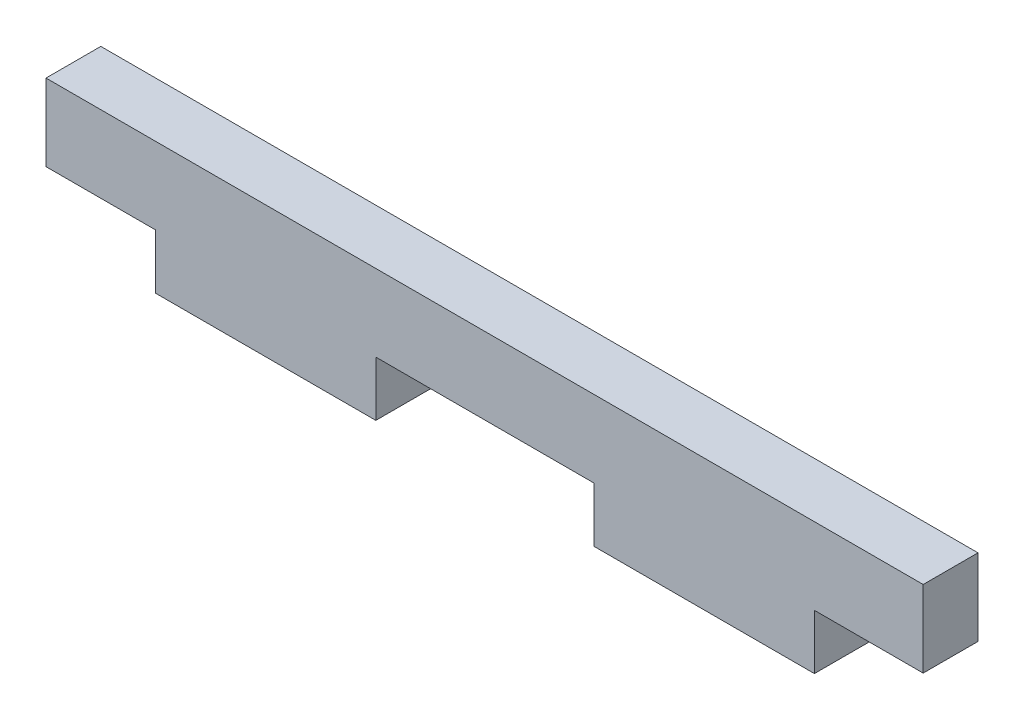
ISO-10303-21;
HEADER;
FILE_DESCRIPTION(('STEP AP214'),'2;1');
FILE_NAME('part.step','',(''),(''),'','','');
FILE_SCHEMA(('AUTOMOTIVE_DESIGN { 1 0 10303 214 1 1 1 1 }'));
ENDSEC;
DATA;
#1=APPLICATION_CONTEXT('core data for automotive mechanical design processes');
#2=APPLICATION_PROTOCOL_DEFINITION('international standard','automotive_design',2000,#1);
#3=PRODUCT_CONTEXT('',#1,'mechanical');
#4=PRODUCT('Part','Part','',(#3));
#5=PRODUCT_RELATED_PRODUCT_CATEGORY('part','',(#4));
#6=PRODUCT_DEFINITION_FORMATION('','',#4);
#7=PRODUCT_DEFINITION_CONTEXT('part definition',#1,'design');
#8=PRODUCT_DEFINITION('design','',#6,#7);
#9=PRODUCT_DEFINITION_SHAPE('','',#8);
#10=(LENGTH_UNIT() NAMED_UNIT(*) SI_UNIT(.MILLI.,.METRE.));
#11=(NAMED_UNIT(*) PLANE_ANGLE_UNIT() SI_UNIT($,.RADIAN.));
#12=(NAMED_UNIT(*) SI_UNIT($,.STERADIAN.) SOLID_ANGLE_UNIT());
#13=UNCERTAINTY_MEASURE_WITH_UNIT(LENGTH_MEASURE(1.E-05),#10,'distance_accuracy_value','');
#14=(GEOMETRIC_REPRESENTATION_CONTEXT(3) GLOBAL_UNCERTAINTY_ASSIGNED_CONTEXT((#13)) GLOBAL_UNIT_ASSIGNED_CONTEXT((#10,
#11,#12)) REPRESENTATION_CONTEXT('',''));
#15=CARTESIAN_POINT('',(0.,0.,0.));
#16=DIRECTION('',(0.,0.,1.));
#17=DIRECTION('',(1.,0.,0.));
#18=AXIS2_PLACEMENT_3D('',#15,#16,#17);
#19=CARTESIAN_POINT('',(19.1008,-2.2225,1.5875));
#20=DIRECTION('',(0.,1.,0.));
#21=DIRECTION('',(-1.,0.,0.));
#22=AXIS2_PLACEMENT_3D('',#19,#20,#21);
#23=PLANE('',#22);
#24=DIRECTION('',(1.,0.,0.));
#25=VECTOR('',#24,1.);
#26=CARTESIAN_POINT('',(19.1008,-2.2225,-1.5875));
#27=LINE('',#26,#25);
#28=CARTESIAN_POINT('',(19.1008,-2.2225,-1.5875));
#29=VERTEX_POINT('',#28);
#30=CARTESIAN_POINT('',(25.4,-2.2225,-1.5875));
#31=VERTEX_POINT('',#30);
#32=EDGE_CURVE('E164',#29,#31,#27,.T.);
#33=ORIENTED_EDGE('',*,*,#32,.T.);
#34=DIRECTION('',(0.,0.,-1.));
#35=VECTOR('',#34,1.);
#36=CARTESIAN_POINT('',(25.4,-2.2225,1.5875));
#37=LINE('',#36,#35);
#38=CARTESIAN_POINT('',(25.4,-2.2225,1.5875));
#39=VERTEX_POINT('',#38);
#40=EDGE_CURVE('E11',#39,#31,#37,.T.);
#41=ORIENTED_EDGE('',*,*,#40,.F.);
#42=DIRECTION('',(1.,0.,0.));
#43=VECTOR('',#42,1.);
#44=CARTESIAN_POINT('',(19.1008,-2.2225,1.5875));
#45=LINE('',#44,#43);
#46=CARTESIAN_POINT('',(19.1008,-2.2225,1.5875));
#47=VERTEX_POINT('',#46);
#48=EDGE_CURVE('E198',#47,#39,#45,.T.);
#49=ORIENTED_EDGE('',*,*,#48,.F.);
#50=DIRECTION('',(0.,0.,-1.));
#51=VECTOR('',#50,1.);
#52=CARTESIAN_POINT('',(19.1008,-2.2225,1.5875));
#53=LINE('',#52,#51);
#54=EDGE_CURVE('E160',#47,#29,#53,.T.);
#55=ORIENTED_EDGE('',*,*,#54,.T.);
#56=EDGE_LOOP('',(#33,#41,#49,#55));
#57=FACE_BOUND('',#56,.T.);
#58=ADVANCED_FACE('F39',(#57),#23,.F.);
#59=CARTESIAN_POINT('',(25.4,2.2225,1.5875));
#60=DIRECTION('',(-1.,0.,0.));
#61=DIRECTION('',(0.,0.,1.));
#62=AXIS2_PLACEMENT_3D('',#59,#60,#61);
#63=PLANE('',#62);
#64=DIRECTION('',(0.,1.,0.));
#65=VECTOR('',#64,1.);
#66=CARTESIAN_POINT('',(25.4,2.2225,-1.5875));
#67=LINE('',#66,#65);
#68=CARTESIAN_POINT('',(25.4,2.2225,-1.5875));
#69=VERTEX_POINT('',#68);
#70=EDGE_CURVE('E168',#31,#69,#67,.T.);
#71=ORIENTED_EDGE('',*,*,#70,.T.);
#72=DIRECTION('',(0.,0.,-1.));
#73=VECTOR('',#72,1.);
#74=CARTESIAN_POINT('',(25.4,2.2225,1.5875));
#75=LINE('',#74,#73);
#76=CARTESIAN_POINT('',(25.4,2.2225,1.5875));
#77=VERTEX_POINT('',#76);
#78=EDGE_CURVE('E48',#77,#69,#75,.T.);
#79=ORIENTED_EDGE('',*,*,#78,.F.);
#80=DIRECTION('',(0.,1.,0.));
#81=VECTOR('',#80,1.);
#82=CARTESIAN_POINT('',(25.4,2.2225,1.5875));
#83=LINE('',#82,#81);
#84=EDGE_CURVE('E111',#39,#77,#83,.T.);
#85=ORIENTED_EDGE('',*,*,#84,.F.);
#86=ORIENTED_EDGE('',*,*,#40,.T.);
#87=EDGE_LOOP('',(#71,#79,#85,#86));
#88=FACE_BOUND('',#87,.T.);
#89=ADVANCED_FACE('F292',(#88),#63,.F.);
#90=CARTESIAN_POINT('',(-25.4,2.2225,1.5875));
#91=DIRECTION('',(0.,-1.,0.));
#92=DIRECTION('',(0.,0.,-1.));
#93=AXIS2_PLACEMENT_3D('',#90,#91,#92);
#94=PLANE('',#93);
#95=DIRECTION('',(-1.,0.,0.));
#96=VECTOR('',#95,1.);
#97=CARTESIAN_POINT('',(-25.4,2.2225,-1.5875));
#98=LINE('',#97,#96);
#99=CARTESIAN_POINT('',(-25.4,2.2225,-1.5875));
#100=VERTEX_POINT('',#99);
#101=EDGE_CURVE('E171',#69,#100,#98,.T.);
#102=ORIENTED_EDGE('',*,*,#101,.T.);
#103=DIRECTION('',(0.,0.,-1.));
#104=VECTOR('',#103,1.);
#105=CARTESIAN_POINT('',(-25.4,2.2225,1.5875));
#106=LINE('',#105,#104);
#107=CARTESIAN_POINT('',(-25.4,2.2225,1.5875));
#108=VERTEX_POINT('',#107);
#109=EDGE_CURVE('E225',#108,#100,#106,.T.);
#110=ORIENTED_EDGE('',*,*,#109,.F.);
#111=DIRECTION('',(-1.,0.,0.));
#112=VECTOR('',#111,1.);
#113=CARTESIAN_POINT('',(-25.4,2.2225,1.5875));
#114=LINE('',#113,#112);
#115=EDGE_CURVE('E235',#77,#108,#114,.T.);
#116=ORIENTED_EDGE('',*,*,#115,.F.);
#117=ORIENTED_EDGE('',*,*,#78,.T.);
#118=EDGE_LOOP('',(#102,#110,#116,#117));
#119=FACE_BOUND('',#118,.T.);
#120=ADVANCED_FACE('F233',(#119),#94,.F.);
#121=CARTESIAN_POINT('',(-25.4,2.2225,1.5875));
#122=DIRECTION('',(1.,0.,0.));
#123=DIRECTION('',(0.,0.,-1.));
#124=AXIS2_PLACEMENT_3D('',#121,#122,#123);
#125=PLANE('',#124);
#126=DIRECTION('',(0.,-1.,0.));
#127=VECTOR('',#126,1.);
#128=CARTESIAN_POINT('',(-25.4,2.2225,-1.5875));
#129=LINE('',#128,#127);
#130=CARTESIAN_POINT('',(-25.4,-2.2225,-1.5875));
#131=VERTEX_POINT('',#130);
#132=EDGE_CURVE('E174',#100,#131,#129,.T.);
#133=ORIENTED_EDGE('',*,*,#132,.T.);
#134=DIRECTION('',(0.,0.,-1.));
#135=VECTOR('',#134,1.);
#136=CARTESIAN_POINT('',(-25.4,-2.2225,1.5875));
#137=LINE('',#136,#135);
#138=CARTESIAN_POINT('',(-25.4,-2.2225,1.5875));
#139=VERTEX_POINT('',#138);
#140=EDGE_CURVE('E221',#139,#131,#137,.T.);
#141=ORIENTED_EDGE('',*,*,#140,.F.);
#142=DIRECTION('',(0.,-1.,0.));
#143=VECTOR('',#142,1.);
#144=CARTESIAN_POINT('',(-25.4,2.2225,1.5875));
#145=LINE('',#144,#143);
#146=EDGE_CURVE('E254',#108,#139,#145,.T.);
#147=ORIENTED_EDGE('',*,*,#146,.F.);
#148=ORIENTED_EDGE('',*,*,#109,.T.);
#149=EDGE_LOOP('',(#133,#141,#147,#148));
#150=FACE_BOUND('',#149,.T.);
#151=ADVANCED_FACE('F244',(#150),#125,.F.);
#152=CARTESIAN_POINT('',(-25.4,-2.2225,1.5875));
#153=DIRECTION('',(0.,1.,0.));
#154=DIRECTION('',(-1.,0.,0.));
#155=AXIS2_PLACEMENT_3D('',#152,#153,#154);
#156=PLANE('',#155);
#157=DIRECTION('',(1.,0.,0.));
#158=VECTOR('',#157,1.);
#159=CARTESIAN_POINT('',(-25.4,-2.2225,-1.5875));
#160=LINE('',#159,#158);
#161=CARTESIAN_POINT('',(-19.05,-2.2225,-1.5875));
#162=VERTEX_POINT('',#161);
#163=EDGE_CURVE('E177',#131,#162,#160,.T.);
#164=ORIENTED_EDGE('',*,*,#163,.T.);
#165=DIRECTION('',(0.,0.,-1.));
#166=VECTOR('',#165,1.);
#167=CARTESIAN_POINT('',(-19.05,-2.2225,1.5875));
#168=LINE('',#167,#166);
#169=CARTESIAN_POINT('',(-19.05,-2.2225,1.5875));
#170=VERTEX_POINT('',#169);
#171=EDGE_CURVE('E217',#170,#162,#168,.T.);
#172=ORIENTED_EDGE('',*,*,#171,.F.);
#173=DIRECTION('',(1.,0.,0.));
#174=VECTOR('',#173,1.);
#175=CARTESIAN_POINT('',(-25.4,-2.2225,1.5875));
#176=LINE('',#175,#174);
#177=EDGE_CURVE('E250',#139,#170,#176,.T.);
#178=ORIENTED_EDGE('',*,*,#177,.F.);
#179=ORIENTED_EDGE('',*,*,#140,.T.);
#180=EDGE_LOOP('',(#164,#172,#178,#179));
#181=FACE_BOUND('',#180,.T.);
#182=ADVANCED_FACE('F248',(#181),#156,.F.);
#183=CARTESIAN_POINT('',(-19.05,-2.2225,1.5875));
#184=DIRECTION('',(1.,0.,0.));
#185=DIRECTION('',(0.,0.,-1.));
#186=AXIS2_PLACEMENT_3D('',#183,#184,#185);
#187=PLANE('',#186);
#188=DIRECTION('',(0.,-1.,0.));
#189=VECTOR('',#188,1.);
#190=CARTESIAN_POINT('',(-19.05,-2.2225,-1.5875));
#191=LINE('',#190,#189);
#192=CARTESIAN_POINT('',(-19.05,-5.39749999999997,-1.5875));
#193=VERTEX_POINT('',#192);
#194=EDGE_CURVE('E180',#162,#193,#191,.T.);
#195=ORIENTED_EDGE('',*,*,#194,.T.);
#196=DIRECTION('',(0.,0.,-1.));
#197=VECTOR('',#196,1.);
#198=CARTESIAN_POINT('',(-19.05,-5.39749999999997,1.5875));
#199=LINE('',#198,#197);
#200=CARTESIAN_POINT('',(-19.05,-5.39749999999997,1.5875));
#201=VERTEX_POINT('',#200);
#202=EDGE_CURVE('E213',#201,#193,#199,.T.);
#203=ORIENTED_EDGE('',*,*,#202,.F.);
#204=DIRECTION('',(0.,-1.,0.));
#205=VECTOR('',#204,1.);
#206=CARTESIAN_POINT('',(-19.05,-2.2225,1.5875));
#207=LINE('',#206,#205);
#208=EDGE_CURVE('E253',#170,#201,#207,.T.);
#209=ORIENTED_EDGE('',*,*,#208,.F.);
#210=ORIENTED_EDGE('',*,*,#171,.T.);
#211=EDGE_LOOP('',(#195,#203,#209,#210));
#212=FACE_BOUND('',#211,.T.);
#213=ADVANCED_FACE('F305',(#212),#187,.F.);
#214=CARTESIAN_POINT('',(-6.29919999999999,-5.39749999999996,1.5875));
#215=DIRECTION('',(0.,1.,0.));
#216=DIRECTION('',(-1.,0.,0.));
#217=AXIS2_PLACEMENT_3D('',#214,#215,#216);
#218=PLANE('',#217);
#219=DIRECTION('',(1.,0.,0.));
#220=VECTOR('',#219,1.);
#221=CARTESIAN_POINT('',(-6.29919999999999,-5.39749999999996,-1.5875));
#222=LINE('',#221,#220);
#223=CARTESIAN_POINT('',(-6.29919999999999,-5.39749999999996,-1.5875));
#224=VERTEX_POINT('',#223);
#225=EDGE_CURVE('E183',#193,#224,#222,.T.);
#226=ORIENTED_EDGE('',*,*,#225,.T.);
#227=DIRECTION('',(0.,0.,-1.));
#228=VECTOR('',#227,1.);
#229=CARTESIAN_POINT('',(-6.29919999999999,-5.39749999999996,1.5875));
#230=LINE('',#229,#228);
#231=CARTESIAN_POINT('',(-6.29919999999999,-5.39749999999996,1.5875));
#232=VERTEX_POINT('',#231);
#233=EDGE_CURVE('E209',#232,#224,#230,.T.);
#234=ORIENTED_EDGE('',*,*,#233,.F.);
#235=DIRECTION('',(1.,0.,0.));
#236=VECTOR('',#235,1.);
#237=CARTESIAN_POINT('',(-6.29919999999999,-5.39749999999996,1.5875));
#238=LINE('',#237,#236);
#239=EDGE_CURVE('E258',#201,#232,#238,.T.);
#240=ORIENTED_EDGE('',*,*,#239,.F.);
#241=ORIENTED_EDGE('',*,*,#202,.T.);
#242=EDGE_LOOP('',(#226,#234,#240,#241));
#243=FACE_BOUND('',#242,.T.);
#244=ADVANCED_FACE('F308',(#243),#218,.F.);
#245=CARTESIAN_POINT('',(-6.2992,-2.2225,1.5875));
#246=DIRECTION('',(-1.,0.,0.));
#247=DIRECTION('',(0.,-1.,0.));
#248=AXIS2_PLACEMENT_3D('',#245,#246,#247);
#249=PLANE('',#248);
#250=DIRECTION('',(0.,1.,0.));
#251=VECTOR('',#250,1.);
#252=CARTESIAN_POINT('',(-6.2992,-2.2225,-1.5875));
#253=LINE('',#252,#251);
#254=CARTESIAN_POINT('',(-6.2992,-2.2225,-1.5875));
#255=VERTEX_POINT('',#254);
#256=EDGE_CURVE('E186',#224,#255,#253,.T.);
#257=ORIENTED_EDGE('',*,*,#256,.T.);
#258=DIRECTION('',(0.,0.,-1.));
#259=VECTOR('',#258,1.);
#260=CARTESIAN_POINT('',(-6.2992,-2.2225,1.5875));
#261=LINE('',#260,#259);
#262=CARTESIAN_POINT('',(-6.2992,-2.2225,1.5875));
#263=VERTEX_POINT('',#262);
#264=EDGE_CURVE('E205',#263,#255,#261,.T.);
#265=ORIENTED_EDGE('',*,*,#264,.F.);
#266=DIRECTION('',(0.,1.,0.));
#267=VECTOR('',#266,1.);
#268=CARTESIAN_POINT('',(-6.2992,-2.2225,1.5875));
#269=LINE('',#268,#267);
#270=EDGE_CURVE('E265',#232,#263,#269,.T.);
#271=ORIENTED_EDGE('',*,*,#270,.F.);
#272=ORIENTED_EDGE('',*,*,#233,.T.);
#273=EDGE_LOOP('',(#257,#265,#271,#272));
#274=FACE_BOUND('',#273,.T.);
#275=ADVANCED_FACE('F273',(#274),#249,.F.);
#276=CARTESIAN_POINT('',(-6.2992,-2.2225,1.5875));
#277=DIRECTION('',(0.,1.,0.));
#278=DIRECTION('',(-1.,0.,0.));
#279=AXIS2_PLACEMENT_3D('',#276,#277,#278);
#280=PLANE('',#279);
#281=DIRECTION('',(1.,0.,0.));
#282=VECTOR('',#281,1.);
#283=CARTESIAN_POINT('',(-6.2992,-2.2225,-1.5875));
#284=LINE('',#283,#282);
#285=CARTESIAN_POINT('',(6.35,-2.2225,-1.5875));
#286=VERTEX_POINT('',#285);
#287=EDGE_CURVE('E189',#255,#286,#284,.T.);
#288=ORIENTED_EDGE('',*,*,#287,.T.);
#289=DIRECTION('',(0.,0.,-1.));
#290=VECTOR('',#289,1.);
#291=CARTESIAN_POINT('',(6.35,-2.2225,1.5875));
#292=LINE('',#291,#290);
#293=CARTESIAN_POINT('',(6.35,-2.2225,1.5875));
#294=VERTEX_POINT('',#293);
#295=EDGE_CURVE('E153',#294,#286,#292,.T.);
#296=ORIENTED_EDGE('',*,*,#295,.F.);
#297=DIRECTION('',(1.,0.,0.));
#298=VECTOR('',#297,1.);
#299=CARTESIAN_POINT('',(-6.2992,-2.2225,1.5875));
#300=LINE('',#299,#298);
#301=EDGE_CURVE('E142',#263,#294,#300,.T.);
#302=ORIENTED_EDGE('',*,*,#301,.F.);
#303=ORIENTED_EDGE('',*,*,#264,.T.);
#304=EDGE_LOOP('',(#288,#296,#302,#303));
#305=FACE_BOUND('',#304,.T.);
#306=ADVANCED_FACE('F277',(#305),#280,.F.);
#307=CARTESIAN_POINT('',(6.35,-2.2225,1.5875));
#308=DIRECTION('',(1.,0.,0.));
#309=DIRECTION('',(0.,0.,-1.));
#310=AXIS2_PLACEMENT_3D('',#307,#308,#309);
#311=PLANE('',#310);
#312=DIRECTION('',(0.,-1.,0.));
#313=VECTOR('',#312,1.);
#314=CARTESIAN_POINT('',(6.35,-2.2225,-1.5875));
#315=LINE('',#314,#313);
#316=CARTESIAN_POINT('',(6.35,-5.39749999999996,-1.5875));
#317=VERTEX_POINT('',#316);
#318=EDGE_CURVE('E151',#286,#317,#315,.T.);
#319=ORIENTED_EDGE('',*,*,#318,.T.);
#320=DIRECTION('',(0.,0.,-1.));
#321=VECTOR('',#320,1.);
#322=CARTESIAN_POINT('',(6.35,-5.39749999999996,1.5875));
#323=LINE('',#322,#321);
#324=CARTESIAN_POINT('',(6.35,-5.39749999999996,1.5875));
#325=VERTEX_POINT('',#324);
#326=EDGE_CURVE('E148',#325,#317,#323,.T.);
#327=ORIENTED_EDGE('',*,*,#326,.F.);
#328=DIRECTION('',(0.,-1.,0.));
#329=VECTOR('',#328,1.);
#330=CARTESIAN_POINT('',(6.35,-2.2225,1.5875));
#331=LINE('',#330,#329);
#332=EDGE_CURVE('E136',#294,#325,#331,.T.);
#333=ORIENTED_EDGE('',*,*,#332,.F.);
#334=ORIENTED_EDGE('',*,*,#295,.T.);
#335=EDGE_LOOP('',(#319,#327,#333,#334));
#336=FACE_BOUND('',#335,.T.);
#337=ADVANCED_FACE('F149',(#336),#311,.F.);
#338=CARTESIAN_POINT('',(6.35,-5.39749999999996,1.5875));
#339=DIRECTION('',(0.,1.,0.));
#340=DIRECTION('',(-1.,0.,0.));
#341=AXIS2_PLACEMENT_3D('',#338,#339,#340);
#342=PLANE('',#341);
#343=DIRECTION('',(1.,0.,0.));
#344=VECTOR('',#343,1.);
#345=CARTESIAN_POINT('',(6.35,-5.39749999999996,-1.5875));
#346=LINE('',#345,#344);
#347=CARTESIAN_POINT('',(19.1008,-5.39749999999996,-1.5875));
#348=VERTEX_POINT('',#347);
#349=EDGE_CURVE('E97',#317,#348,#346,.T.);
#350=ORIENTED_EDGE('',*,*,#349,.T.);
#351=DIRECTION('',(0.,0.,-1.));
#352=VECTOR('',#351,1.);
#353=CARTESIAN_POINT('',(19.1008,-5.39749999999996,1.5875));
#354=LINE('',#353,#352);
#355=CARTESIAN_POINT('',(19.1008,-5.39749999999996,1.5875));
#356=VERTEX_POINT('',#355);
#357=EDGE_CURVE('E154',#356,#348,#354,.T.);
#358=ORIENTED_EDGE('',*,*,#357,.F.);
#359=DIRECTION('',(1.,0.,0.));
#360=VECTOR('',#359,1.);
#361=CARTESIAN_POINT('',(6.35,-5.39749999999996,1.5875));
#362=LINE('',#361,#360);
#363=EDGE_CURVE('E140',#325,#356,#362,.T.);
#364=ORIENTED_EDGE('',*,*,#363,.F.);
#365=ORIENTED_EDGE('',*,*,#326,.T.);
#366=EDGE_LOOP('',(#350,#358,#364,#365));
#367=FACE_BOUND('',#366,.T.);
#368=ADVANCED_FACE('F156',(#367),#342,.F.);
#369=CARTESIAN_POINT('',(19.1008,-2.2225,1.5875));
#370=DIRECTION('',(-1.,0.,0.));
#371=DIRECTION('',(0.,0.,1.));
#372=AXIS2_PLACEMENT_3D('',#369,#370,#371);
#373=PLANE('',#372);
#374=DIRECTION('',(0.,1.,0.));
#375=VECTOR('',#374,1.);
#376=CARTESIAN_POINT('',(19.1008,-2.2225,-1.5875));
#377=LINE('',#376,#375);
#378=EDGE_CURVE('E103',#348,#29,#377,.T.);
#379=ORIENTED_EDGE('',*,*,#378,.T.);
#380=ORIENTED_EDGE('',*,*,#54,.F.);
#381=DIRECTION('',(0.,1.,0.));
#382=VECTOR('',#381,1.);
#383=CARTESIAN_POINT('',(19.1008,-2.2225,1.5875));
#384=LINE('',#383,#382);
#385=EDGE_CURVE('E56',#356,#47,#384,.T.);
#386=ORIENTED_EDGE('',*,*,#385,.F.);
#387=ORIENTED_EDGE('',*,*,#357,.T.);
#388=EDGE_LOOP('',(#379,#380,#386,#387));
#389=FACE_BOUND('',#388,.T.);
#390=ADVANCED_FACE('F281',(#389),#373,.F.);
#391=CARTESIAN_POINT('',(0.,0.,1.5875));
#392=DIRECTION('',(0.,0.,-1.));
#393=DIRECTION('',(-1.,0.,0.));
#394=AXIS2_PLACEMENT_3D('',#391,#392,#393);
#395=PLANE('',#394);
#396=ORIENTED_EDGE('',*,*,#48,.T.);
#397=ORIENTED_EDGE('',*,*,#84,.T.);
#398=ORIENTED_EDGE('',*,*,#115,.T.);
#399=ORIENTED_EDGE('',*,*,#146,.T.);
#400=ORIENTED_EDGE('',*,*,#177,.T.);
#401=ORIENTED_EDGE('',*,*,#208,.T.);
#402=ORIENTED_EDGE('',*,*,#239,.T.);
#403=ORIENTED_EDGE('',*,*,#270,.T.);
#404=ORIENTED_EDGE('',*,*,#301,.T.);
#405=ORIENTED_EDGE('',*,*,#332,.T.);
#406=ORIENTED_EDGE('',*,*,#363,.T.);
#407=ORIENTED_EDGE('',*,*,#385,.T.);
#408=EDGE_LOOP('',(#396,#397,#398,#399,#400,#401,#402,#403,#404,#405,#406,#407));
#409=FACE_BOUND('',#408,.T.);
#410=ADVANCED_FACE('F138',(#409),#395,.F.);
#411=CARTESIAN_POINT('',(0.,0.,-1.5875));
#412=DIRECTION('',(0.,0.,-1.));
#413=DIRECTION('',(-1.,0.,0.));
#414=AXIS2_PLACEMENT_3D('',#411,#412,#413);
#415=PLANE('',#414);
#416=ORIENTED_EDGE('',*,*,#32,.F.);
#417=ORIENTED_EDGE('',*,*,#378,.F.);
#418=ORIENTED_EDGE('',*,*,#349,.F.);
#419=ORIENTED_EDGE('',*,*,#318,.F.);
#420=ORIENTED_EDGE('',*,*,#287,.F.);
#421=ORIENTED_EDGE('',*,*,#256,.F.);
#422=ORIENTED_EDGE('',*,*,#225,.F.);
#423=ORIENTED_EDGE('',*,*,#194,.F.);
#424=ORIENTED_EDGE('',*,*,#163,.F.);
#425=ORIENTED_EDGE('',*,*,#132,.F.);
#426=ORIENTED_EDGE('',*,*,#101,.F.);
#427=ORIENTED_EDGE('',*,*,#70,.F.);
#428=EDGE_LOOP('',(#416,#417,#418,#419,#420,#421,#422,#423,#424,#425,#426,#427));
#429=FACE_BOUND('',#428,.T.);
#430=ADVANCED_FACE('F239',(#429),#415,.T.);
#431=CLOSED_SHELL('',(#58,#89,#120,#151,#182,#213,#244,#275,#306,#337,#368,#390,#410,#430));
#432=MANIFOLD_SOLID_BREP('B2',#431);
#433=ADVANCED_BREP_SHAPE_REPRESENTATION('',(#18,#432),#14);
#434=SHAPE_DEFINITION_REPRESENTATION(#9,#433);
ENDSEC;
END-ISO-10303-21;
